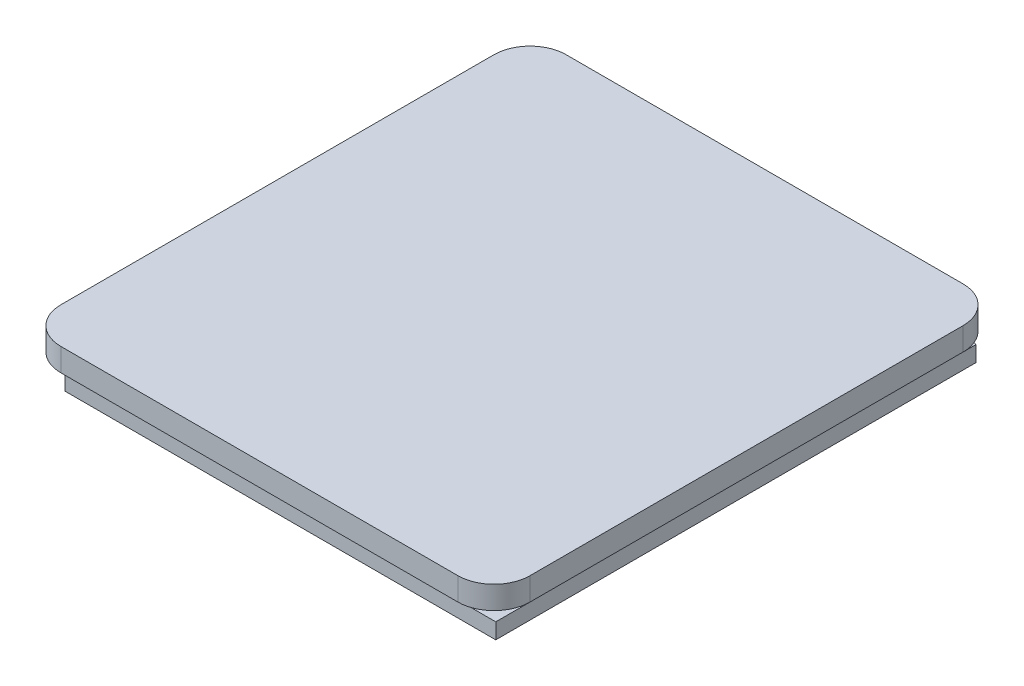
ISO-10303-21;
HEADER;
FILE_DESCRIPTION(('STEP AP214'),'2;1');
FILE_NAME('part.step','',(''),(''),'','','');
FILE_SCHEMA(('AUTOMOTIVE_DESIGN { 1 0 10303 214 1 1 1 1 }'));
ENDSEC;
DATA;
#1=APPLICATION_CONTEXT('core data for automotive mechanical design processes');
#2=APPLICATION_PROTOCOL_DEFINITION('international standard','automotive_design',2000,#1);
#3=PRODUCT_CONTEXT('',#1,'mechanical');
#4=PRODUCT('Part','Part','',(#3));
#5=PRODUCT_RELATED_PRODUCT_CATEGORY('part','',(#4));
#6=PRODUCT_DEFINITION_FORMATION('','',#4);
#7=PRODUCT_DEFINITION_CONTEXT('part definition',#1,'design');
#8=PRODUCT_DEFINITION('design','',#6,#7);
#9=PRODUCT_DEFINITION_SHAPE('','',#8);
#10=(LENGTH_UNIT() NAMED_UNIT(*) SI_UNIT(.MILLI.,.METRE.));
#11=(NAMED_UNIT(*) PLANE_ANGLE_UNIT() SI_UNIT($,.RADIAN.));
#12=(NAMED_UNIT(*) SI_UNIT($,.STERADIAN.) SOLID_ANGLE_UNIT());
#13=UNCERTAINTY_MEASURE_WITH_UNIT(LENGTH_MEASURE(1.E-05),#10,'distance_accuracy_value','');
#14=(GEOMETRIC_REPRESENTATION_CONTEXT(3) GLOBAL_UNCERTAINTY_ASSIGNED_CONTEXT((#13)) GLOBAL_UNIT_ASSIGNED_CONTEXT((#10,
#11,#12)) REPRESENTATION_CONTEXT('',''));
#15=CARTESIAN_POINT('',(0.,0.,0.));
#16=DIRECTION('',(0.,0.,1.));
#17=DIRECTION('',(1.,0.,0.));
#18=AXIS2_PLACEMENT_3D('',#15,#16,#17);
#19=CARTESIAN_POINT('',(-16.5,4.8,21.));
#20=DIRECTION('',(0.,0.,-1.));
#21=DIRECTION('',(-1.,0.,0.));
#22=AXIS2_PLACEMENT_3D('',#19,#20,#21);
#23=PLANE('',#22);
#24=DIRECTION('',(1.,0.,0.));
#25=VECTOR('',#24,1.);
#26=CARTESIAN_POINT('',(0.,2.9,21.));
#27=LINE('',#26,#25);
#28=CARTESIAN_POINT('',(-16.5,2.9,21.));
#29=VERTEX_POINT('',#28);
#30=CARTESIAN_POINT('',(16.5,2.9,21.));
#31=VERTEX_POINT('',#30);
#32=EDGE_CURVE('E199',#29,#31,#27,.T.);
#33=ORIENTED_EDGE('',*,*,#32,.T.);
#34=DIRECTION('',(0.,-1.,0.));
#35=VECTOR('',#34,1.);
#36=CARTESIAN_POINT('',(16.5,4.8,21.));
#37=LINE('',#36,#35);
#38=CARTESIAN_POINT('',(16.5,4.8,21.));
#39=VERTEX_POINT('',#38);
#40=EDGE_CURVE('E269',#39,#31,#37,.T.);
#41=ORIENTED_EDGE('',*,*,#40,.F.);
#42=DIRECTION('',(1.,0.,0.));
#43=VECTOR('',#42,1.);
#44=CARTESIAN_POINT('',(-16.5,4.8,21.));
#45=LINE('',#44,#43);
#46=CARTESIAN_POINT('',(-16.5,4.8,21.));
#47=VERTEX_POINT('',#46);
#48=EDGE_CURVE('E227',#47,#39,#45,.T.);
#49=ORIENTED_EDGE('',*,*,#48,.F.);
#50=DIRECTION('',(0.,-1.,0.));
#51=VECTOR('',#50,1.);
#52=CARTESIAN_POINT('',(-16.5,4.8,21.));
#53=LINE('',#52,#51);
#54=EDGE_CURVE('E272',#47,#29,#53,.T.);
#55=ORIENTED_EDGE('',*,*,#54,.T.);
#56=EDGE_LOOP('',(#33,#41,#49,#55));
#57=FACE_BOUND('',#56,.T.);
#58=ADVANCED_FACE('F32',(#57),#23,.F.);
#59=CARTESIAN_POINT('',(-16.5,4.8,-21.));
#60=DIRECTION('',(0.,0.,1.));
#61=DIRECTION('',(1.,0.,0.));
#62=AXIS2_PLACEMENT_3D('',#59,#60,#61);
#63=PLANE('',#62);
#64=DIRECTION('',(-1.,0.,0.));
#65=VECTOR('',#64,1.);
#66=CARTESIAN_POINT('',(-16.5,1.3,-21.));
#67=LINE('',#66,#65);
#68=CARTESIAN_POINT('',(16.5,1.3,-21.));
#69=VERTEX_POINT('',#68);
#70=CARTESIAN_POINT('',(16.2,1.3,-21.));
#71=VERTEX_POINT('',#70);
#72=EDGE_CURVE('E182',#69,#71,#67,.T.);
#73=ORIENTED_EDGE('',*,*,#72,.F.);
#74=DIRECTION('',(0.,-1.,0.));
#75=VECTOR('',#74,1.);
#76=CARTESIAN_POINT('',(16.5,4.8,-21.));
#77=LINE('',#76,#75);
#78=CARTESIAN_POINT('',(16.5,0.,-21.));
#79=VERTEX_POINT('',#78);
#80=EDGE_CURVE('E259',#69,#79,#77,.T.);
#81=ORIENTED_EDGE('',*,*,#80,.T.);
#82=DIRECTION('',(-1.,0.,0.));
#83=VECTOR('',#82,1.);
#84=CARTESIAN_POINT('',(-16.5,0.,-21.));
#85=LINE('',#84,#83);
#86=CARTESIAN_POINT('',(-16.5,0.,-21.));
#87=VERTEX_POINT('',#86);
#88=EDGE_CURVE('E245',#79,#87,#85,.T.);
#89=ORIENTED_EDGE('',*,*,#88,.T.);
#90=DIRECTION('',(0.,-1.,0.));
#91=VECTOR('',#90,1.);
#92=CARTESIAN_POINT('',(-16.5,4.8,-21.));
#93=LINE('',#92,#91);
#94=CARTESIAN_POINT('',(-16.5,1.3,-21.));
#95=VERTEX_POINT('',#94);
#96=EDGE_CURVE('E255',#95,#87,#93,.T.);
#97=ORIENTED_EDGE('',*,*,#96,.F.);
#98=DIRECTION('',(1.,0.,0.));
#99=VECTOR('',#98,1.);
#100=CARTESIAN_POINT('',(-16.5,1.3,-21.));
#101=LINE('',#100,#99);
#102=CARTESIAN_POINT('',(-16.2,1.3,-21.));
#103=VERTEX_POINT('',#102);
#104=EDGE_CURVE('E220',#95,#103,#101,.T.);
#105=ORIENTED_EDGE('',*,*,#104,.T.);
#106=DIRECTION('',(0.,-1.,0.));
#107=VECTOR('',#106,1.);
#108=CARTESIAN_POINT('',(-16.2,4.8,-21.));
#109=LINE('',#108,#107);
#110=CARTESIAN_POINT('',(-16.2,2.9,-21.));
#111=VERTEX_POINT('',#110);
#112=EDGE_CURVE('E280',#111,#103,#109,.T.);
#113=ORIENTED_EDGE('',*,*,#112,.F.);
#114=DIRECTION('',(1.,0.,0.));
#115=VECTOR('',#114,1.);
#116=CARTESIAN_POINT('',(-16.5,2.9,-21.));
#117=LINE('',#116,#115);
#118=CARTESIAN_POINT('',(-16.5,2.9,-21.));
#119=VERTEX_POINT('',#118);
#120=EDGE_CURVE('E215',#119,#111,#117,.T.);
#121=ORIENTED_EDGE('',*,*,#120,.F.);
#122=CARTESIAN_POINT('',(-16.5,4.8,-21.));
#123=VERTEX_POINT('',#122);
#124=EDGE_CURVE('E256',#123,#119,#93,.T.);
#125=ORIENTED_EDGE('',*,*,#124,.F.);
#126=DIRECTION('',(-1.,0.,0.));
#127=VECTOR('',#126,1.);
#128=CARTESIAN_POINT('',(-16.5,4.8,-21.));
#129=LINE('',#128,#127);
#130=CARTESIAN_POINT('',(16.5,4.8,-21.));
#131=VERTEX_POINT('',#130);
#132=EDGE_CURVE('E236',#131,#123,#129,.T.);
#133=ORIENTED_EDGE('',*,*,#132,.F.);
#134=CARTESIAN_POINT('',(16.5,2.9,-21.));
#135=VERTEX_POINT('',#134);
#136=EDGE_CURVE('E260',#131,#135,#77,.T.);
#137=ORIENTED_EDGE('',*,*,#136,.T.);
#138=DIRECTION('',(1.,0.,0.));
#139=VECTOR('',#138,1.);
#140=CARTESIAN_POINT('',(-16.5,2.9,-21.));
#141=LINE('',#140,#139);
#142=CARTESIAN_POINT('',(16.2,2.9,-21.));
#143=VERTEX_POINT('',#142);
#144=EDGE_CURVE('E183',#143,#135,#141,.T.);
#145=ORIENTED_EDGE('',*,*,#144,.F.);
#146=DIRECTION('',(0.,-1.,0.));
#147=VECTOR('',#146,1.);
#148=CARTESIAN_POINT('',(16.2,4.8,-21.));
#149=LINE('',#148,#147);
#150=EDGE_CURVE('E40',#143,#71,#149,.T.);
#151=ORIENTED_EDGE('',*,*,#150,.T.);
#152=EDGE_LOOP('',(#73,#81,#89,#97,#105,#113,#121,#125,#133,#137,#145,#151));
#153=FACE_BOUND('',#152,.T.);
#154=ADVANCED_FACE('F289',(#153),#63,.F.);
#155=CARTESIAN_POINT('',(16.5,4.8,18.));
#156=DIRECTION('',(0.,-1.,0.));
#157=DIRECTION('',(0.,0.,-1.));
#158=AXIS2_PLACEMENT_3D('',#155,#156,#157);
#159=CYLINDRICAL_SURFACE('',#158,3.);
#160=CARTESIAN_POINT('',(16.5,2.9,18.));
#161=DIRECTION('',(0.,-1.,0.));
#162=DIRECTION('',(0.,0.,-1.));
#163=AXIS2_PLACEMENT_3D('',#160,#161,#162);
#164=CIRCLE('',#163,3.);
#165=CARTESIAN_POINT('',(19.5,2.9,17.9999999999999));
#166=VERTEX_POINT('',#165);
#167=EDGE_CURVE('E185',#166,#31,#164,.T.);
#168=ORIENTED_EDGE('',*,*,#167,.F.);
#169=DIRECTION('',(0.,-1.,0.));
#170=VECTOR('',#169,1.);
#171=CARTESIAN_POINT('',(19.5,4.8,18.));
#172=LINE('',#171,#170);
#173=CARTESIAN_POINT('',(19.5,4.8,18.));
#174=VERTEX_POINT('',#173);
#175=EDGE_CURVE('E266',#174,#166,#172,.T.);
#176=ORIENTED_EDGE('',*,*,#175,.F.);
#177=CARTESIAN_POINT('',(16.5,4.8,18.));
#178=DIRECTION('',(0.,1.,0.));
#179=DIRECTION('',(0.,0.,1.));
#180=AXIS2_PLACEMENT_3D('',#177,#178,#179);
#181=CIRCLE('',#180,3.);
#182=EDGE_CURVE('E230',#39,#174,#181,.T.);
#183=ORIENTED_EDGE('',*,*,#182,.F.);
#184=ORIENTED_EDGE('',*,*,#40,.T.);
#185=EDGE_LOOP('',(#168,#176,#183,#184));
#186=FACE_BOUND('',#185,.T.);
#187=ADVANCED_FACE('F334',(#186),#159,.T.);
#188=CARTESIAN_POINT('',(19.5,4.8,18.));
#189=DIRECTION('',(-1.,0.,0.));
#190=DIRECTION('',(0.,0.,1.));
#191=AXIS2_PLACEMENT_3D('',#188,#189,#190);
#192=PLANE('',#191);
#193=DIRECTION('',(0.,0.,1.));
#194=VECTOR('',#193,1.);
#195=CARTESIAN_POINT('',(19.5,2.9,-93.8));
#196=LINE('',#195,#194);
#197=CARTESIAN_POINT('',(19.5,2.9,-18.));
#198=VERTEX_POINT('',#197);
#199=EDGE_CURVE('E187',#198,#166,#196,.T.);
#200=ORIENTED_EDGE('',*,*,#199,.F.);
#201=DIRECTION('',(0.,-1.,0.));
#202=VECTOR('',#201,1.);
#203=CARTESIAN_POINT('',(19.5,4.8,-18.));
#204=LINE('',#203,#202);
#205=CARTESIAN_POINT('',(19.5,4.8,-18.));
#206=VERTEX_POINT('',#205);
#207=EDGE_CURVE('E263',#206,#198,#204,.T.);
#208=ORIENTED_EDGE('',*,*,#207,.F.);
#209=DIRECTION('',(0.,0.,-1.));
#210=VECTOR('',#209,1.);
#211=CARTESIAN_POINT('',(19.5,4.8,18.));
#212=LINE('',#211,#210);
#213=EDGE_CURVE('E232',#174,#206,#212,.T.);
#214=ORIENTED_EDGE('',*,*,#213,.F.);
#215=ORIENTED_EDGE('',*,*,#175,.T.);
#216=EDGE_LOOP('',(#200,#208,#214,#215));
#217=FACE_BOUND('',#216,.T.);
#218=ADVANCED_FACE('F339',(#217),#192,.F.);
#219=CARTESIAN_POINT('',(16.5,4.8,-18.));
#220=DIRECTION('',(0.,-1.,0.));
#221=DIRECTION('',(0.,0.,-1.));
#222=AXIS2_PLACEMENT_3D('',#219,#220,#221);
#223=CYLINDRICAL_SURFACE('',#222,3.);
#224=CARTESIAN_POINT('',(16.5,2.9,-18.));
#225=DIRECTION('',(0.,-1.,0.));
#226=DIRECTION('',(0.,0.,-1.));
#227=AXIS2_PLACEMENT_3D('',#224,#225,#226);
#228=CIRCLE('',#227,3.);
#229=EDGE_CURVE('E286',#135,#198,#228,.T.);
#230=ORIENTED_EDGE('',*,*,#229,.F.);
#231=ORIENTED_EDGE('',*,*,#136,.F.);
#232=CARTESIAN_POINT('',(16.5,4.8,-18.));
#233=DIRECTION('',(0.,1.,0.));
#234=DIRECTION('',(0.,0.,-1.));
#235=AXIS2_PLACEMENT_3D('',#232,#233,#234);
#236=CIRCLE('',#235,3.);
#237=EDGE_CURVE('E234',#206,#131,#236,.T.);
#238=ORIENTED_EDGE('',*,*,#237,.F.);
#239=ORIENTED_EDGE('',*,*,#207,.T.);
#240=EDGE_LOOP('',(#230,#231,#238,#239));
#241=FACE_BOUND('',#240,.T.);
#242=ADVANCED_FACE('F343',(#241),#223,.T.);
#243=CARTESIAN_POINT('',(16.5,1.3,-18.));
#244=DIRECTION('',(0.,1.,0.));
#245=DIRECTION('',(-1.,0.,0.));
#246=AXIS2_PLACEMENT_3D('',#243,#244,#245);
#247=CIRCLE('',#246,3.);
#248=CARTESIAN_POINT('',(17.9,1.3,-20.6532998322844));
#249=VERTEX_POINT('',#248);
#250=EDGE_CURVE('E284',#249,#69,#247,.T.);
#251=ORIENTED_EDGE('',*,*,#250,.F.);
#252=DIRECTION('',(0.,-1.,0.));
#253=VECTOR('',#252,1.);
#254=CARTESIAN_POINT('',(17.9,4.8,-20.6532998322843));
#255=LINE('',#254,#253);
#256=CARTESIAN_POINT('',(17.9,0.,-20.6532998322843));
#257=VERTEX_POINT('',#256);
#258=EDGE_CURVE('E282',#249,#257,#255,.T.);
#259=ORIENTED_EDGE('',*,*,#258,.T.);
#260=CARTESIAN_POINT('',(16.5,0.,-18.));
#261=DIRECTION('',(0.,1.,0.));
#262=DIRECTION('',(0.,0.,-1.));
#263=AXIS2_PLACEMENT_3D('',#260,#261,#262);
#264=CIRCLE('',#263,3.);
#265=EDGE_CURVE('E223',#257,#79,#264,.T.);
#266=ORIENTED_EDGE('',*,*,#265,.T.);
#267=ORIENTED_EDGE('',*,*,#80,.F.);
#268=EDGE_LOOP('',(#251,#259,#266,#267));
#269=FACE_BOUND('',#268,.T.);
#270=ADVANCED_FACE('F318',(#269),#223,.T.);
#271=CARTESIAN_POINT('',(-16.5,4.8,18.));
#272=DIRECTION('',(0.,-1.,0.));
#273=DIRECTION('',(0.,0.,-1.));
#274=AXIS2_PLACEMENT_3D('',#271,#272,#273);
#275=CYLINDRICAL_SURFACE('',#274,3.);
#276=CARTESIAN_POINT('',(-16.5,2.9,18.));
#277=DIRECTION('',(0.,-1.,0.));
#278=DIRECTION('',(1.,0.,0.));
#279=AXIS2_PLACEMENT_3D('',#276,#277,#278);
#280=CIRCLE('',#279,3.);
#281=CARTESIAN_POINT('',(-19.5,2.9,17.9999999999999));
#282=VERTEX_POINT('',#281);
#283=EDGE_CURVE('E217',#29,#282,#280,.T.);
#284=ORIENTED_EDGE('',*,*,#283,.F.);
#285=ORIENTED_EDGE('',*,*,#54,.F.);
#286=CARTESIAN_POINT('',(-16.5,4.8,18.));
#287=DIRECTION('',(0.,1.,0.));
#288=DIRECTION('',(0.,0.,-1.));
#289=AXIS2_PLACEMENT_3D('',#286,#287,#288);
#290=CIRCLE('',#289,3.);
#291=CARTESIAN_POINT('',(-19.5,4.8,18.));
#292=VERTEX_POINT('',#291);
#293=EDGE_CURVE('E224',#292,#47,#290,.T.);
#294=ORIENTED_EDGE('',*,*,#293,.F.);
#295=DIRECTION('',(0.,-1.,0.));
#296=VECTOR('',#295,1.);
#297=CARTESIAN_POINT('',(-19.5,4.8,18.));
#298=LINE('',#297,#296);
#299=EDGE_CURVE('E242',#292,#282,#298,.T.);
#300=ORIENTED_EDGE('',*,*,#299,.T.);
#301=EDGE_LOOP('',(#284,#285,#294,#300));
#302=FACE_BOUND('',#301,.T.);
#303=ADVANCED_FACE('F34',(#302),#275,.T.);
#304=CARTESIAN_POINT('',(-16.5,4.8,-18.));
#305=DIRECTION('',(0.,-1.,0.));
#306=DIRECTION('',(0.,0.,-1.));
#307=AXIS2_PLACEMENT_3D('',#304,#305,#306);
#308=CYLINDRICAL_SURFACE('',#307,3.);
#309=CARTESIAN_POINT('',(-16.5,2.9,-18.));
#310=DIRECTION('',(0.,-1.,0.));
#311=DIRECTION('',(1.,0.,0.));
#312=AXIS2_PLACEMENT_3D('',#309,#310,#311);
#313=CIRCLE('',#312,3.);
#314=CARTESIAN_POINT('',(-19.5,2.9,-18.));
#315=VERTEX_POINT('',#314);
#316=EDGE_CURVE('E213',#315,#119,#313,.T.);
#317=ORIENTED_EDGE('',*,*,#316,.F.);
#318=DIRECTION('',(0.,-1.,0.));
#319=VECTOR('',#318,1.);
#320=CARTESIAN_POINT('',(-19.5,4.8,-18.));
#321=LINE('',#320,#319);
#322=CARTESIAN_POINT('',(-19.5,4.8,-18.));
#323=VERTEX_POINT('',#322);
#324=EDGE_CURVE('E252',#323,#315,#321,.T.);
#325=ORIENTED_EDGE('',*,*,#324,.F.);
#326=CARTESIAN_POINT('',(-16.5,4.8,-18.));
#327=DIRECTION('',(0.,1.,0.));
#328=DIRECTION('',(0.,0.,-1.));
#329=AXIS2_PLACEMENT_3D('',#326,#327,#328);
#330=CIRCLE('',#329,3.);
#331=EDGE_CURVE('E238',#123,#323,#330,.T.);
#332=ORIENTED_EDGE('',*,*,#331,.F.);
#333=ORIENTED_EDGE('',*,*,#124,.T.);
#334=EDGE_LOOP('',(#317,#325,#332,#333));
#335=FACE_BOUND('',#334,.T.);
#336=ADVANCED_FACE('F351',(#335),#308,.T.);
#337=CARTESIAN_POINT('',(-19.5,4.8,18.));
#338=DIRECTION('',(1.,0.,0.));
#339=DIRECTION('',(0.,0.,-1.));
#340=AXIS2_PLACEMENT_3D('',#337,#338,#339);
#341=PLANE('',#340);
#342=DIRECTION('',(0.,0.,1.));
#343=VECTOR('',#342,1.);
#344=CARTESIAN_POINT('',(-19.5,2.9,-93.8));
#345=LINE('',#344,#343);
#346=EDGE_CURVE('E202',#315,#282,#345,.T.);
#347=ORIENTED_EDGE('',*,*,#346,.T.);
#348=ORIENTED_EDGE('',*,*,#299,.F.);
#349=DIRECTION('',(0.,0.,1.));
#350=VECTOR('',#349,1.);
#351=CARTESIAN_POINT('',(-19.5,4.8,18.));
#352=LINE('',#351,#350);
#353=EDGE_CURVE('E240',#323,#292,#352,.T.);
#354=ORIENTED_EDGE('',*,*,#353,.F.);
#355=ORIENTED_EDGE('',*,*,#324,.T.);
#356=EDGE_LOOP('',(#347,#348,#354,#355));
#357=FACE_BOUND('',#356,.T.);
#358=ADVANCED_FACE('F352',(#357),#341,.F.);
#359=CARTESIAN_POINT('',(-16.5,0.,18.));
#360=DIRECTION('',(0.,-1.,0.));
#361=DIRECTION('',(0.,0.,-1.));
#362=AXIS2_PLACEMENT_3D('',#359,#360,#361);
#363=PLANE('',#362);
#364=DIRECTION('',(-1.,0.,0.));
#365=VECTOR('',#364,1.);
#366=CARTESIAN_POINT('',(95.3,0.,19.25));
#367=LINE('',#366,#365);
#368=CARTESIAN_POINT('',(17.9,0.,19.2499999999999));
#369=VERTEX_POINT('',#368);
#370=CARTESIAN_POINT('',(-17.9,0.,19.25));
#371=VERTEX_POINT('',#370);
#372=EDGE_CURVE('E47',#369,#371,#367,.T.);
#373=ORIENTED_EDGE('',*,*,#372,.T.);
#374=DIRECTION('',(0.,0.,-1.));
#375=VECTOR('',#374,1.);
#376=CARTESIAN_POINT('',(-17.9,0.,18.));
#377=LINE('',#376,#375);
#378=CARTESIAN_POINT('',(-17.9,0.,-20.6532998322843));
#379=VERTEX_POINT('',#378);
#380=EDGE_CURVE('E275',#371,#379,#377,.T.);
#381=ORIENTED_EDGE('',*,*,#380,.T.);
#382=CARTESIAN_POINT('',(-16.5,0.,-18.));
#383=DIRECTION('',(0.,1.,0.));
#384=DIRECTION('',(0.,0.,-1.));
#385=AXIS2_PLACEMENT_3D('',#382,#383,#384);
#386=CIRCLE('',#385,3.);
#387=EDGE_CURVE('E228',#87,#379,#386,.T.);
#388=ORIENTED_EDGE('',*,*,#387,.F.);
#389=ORIENTED_EDGE('',*,*,#88,.F.);
#390=ORIENTED_EDGE('',*,*,#265,.F.);
#391=DIRECTION('',(0.,0.,1.));
#392=VECTOR('',#391,1.);
#393=CARTESIAN_POINT('',(17.9,0.,-93.8));
#394=LINE('',#393,#392);
#395=EDGE_CURVE('E53',#257,#369,#394,.T.);
#396=ORIENTED_EDGE('',*,*,#395,.T.);
#397=EDGE_LOOP('',(#373,#381,#388,#389,#390,#396));
#398=FACE_BOUND('',#397,.T.);
#399=ADVANCED_FACE('F310',(#398),#363,.T.);
#400=DIRECTION('',(0.,-1.,0.));
#401=VECTOR('',#400,1.);
#402=CARTESIAN_POINT('',(-17.9,4.8,-20.6532998322843));
#403=LINE('',#402,#401);
#404=CARTESIAN_POINT('',(-17.9,1.3,-20.6532998322844));
#405=VERTEX_POINT('',#404);
#406=EDGE_CURVE('E204',#405,#379,#403,.T.);
#407=ORIENTED_EDGE('',*,*,#406,.F.);
#408=CARTESIAN_POINT('',(-16.5,1.3,-18.));
#409=DIRECTION('',(0.,-1.,0.));
#410=DIRECTION('',(1.,0.,0.));
#411=AXIS2_PLACEMENT_3D('',#408,#409,#410);
#412=CIRCLE('',#411,3.);
#413=EDGE_CURVE('E277',#405,#95,#412,.T.);
#414=ORIENTED_EDGE('',*,*,#413,.T.);
#415=ORIENTED_EDGE('',*,*,#96,.T.);
#416=ORIENTED_EDGE('',*,*,#387,.T.);
#417=EDGE_LOOP('',(#407,#414,#415,#416));
#418=FACE_BOUND('',#417,.T.);
#419=ADVANCED_FACE('F314',(#418),#308,.T.);
#420=CARTESIAN_POINT('',(-16.5,4.8,18.));
#421=DIRECTION('',(0.,-1.,0.));
#422=DIRECTION('',(0.,0.,-1.));
#423=AXIS2_PLACEMENT_3D('',#420,#421,#422);
#424=PLANE('',#423);
#425=ORIENTED_EDGE('',*,*,#293,.T.);
#426=ORIENTED_EDGE('',*,*,#48,.T.);
#427=ORIENTED_EDGE('',*,*,#182,.T.);
#428=ORIENTED_EDGE('',*,*,#213,.T.);
#429=ORIENTED_EDGE('',*,*,#237,.T.);
#430=ORIENTED_EDGE('',*,*,#132,.T.);
#431=ORIENTED_EDGE('',*,*,#331,.T.);
#432=ORIENTED_EDGE('',*,*,#353,.T.);
#433=EDGE_LOOP('',(#425,#426,#427,#428,#429,#430,#431,#432));
#434=FACE_BOUND('',#433,.T.);
#435=ADVANCED_FACE('F350',(#434),#424,.F.);
#436=CARTESIAN_POINT('',(-16.2,0.,-93.8));
#437=DIRECTION('',(-1.,0.,0.));
#438=DIRECTION('',(0.,0.,1.));
#439=AXIS2_PLACEMENT_3D('',#436,#437,#438);
#440=PLANE('',#439);
#441=DIRECTION('',(0.,-1.,0.));
#442=VECTOR('',#441,1.);
#443=CARTESIAN_POINT('',(-16.2,0.,17.4999999999999));
#444=LINE('',#443,#442);
#445=CARTESIAN_POINT('',(-16.2,2.9,17.4999999999999));
#446=VERTEX_POINT('',#445);
#447=CARTESIAN_POINT('',(-16.2,1.3,17.4999999999999));
#448=VERTEX_POINT('',#447);
#449=EDGE_CURVE('E162',#446,#448,#444,.T.);
#450=ORIENTED_EDGE('',*,*,#449,.F.);
#451=DIRECTION('',(0.,0.,1.));
#452=VECTOR('',#451,1.);
#453=CARTESIAN_POINT('',(-16.2,2.9,-93.8));
#454=LINE('',#453,#452);
#455=EDGE_CURVE('E205',#111,#446,#454,.T.);
#456=ORIENTED_EDGE('',*,*,#455,.F.);
#457=ORIENTED_EDGE('',*,*,#112,.T.);
#458=DIRECTION('',(0.,0.,1.));
#459=VECTOR('',#458,1.);
#460=CARTESIAN_POINT('',(-16.2,1.3,-93.8));
#461=LINE('',#460,#459);
#462=EDGE_CURVE('E208',#103,#448,#461,.T.);
#463=ORIENTED_EDGE('',*,*,#462,.T.);
#464=EDGE_LOOP('',(#450,#456,#457,#463));
#465=FACE_BOUND('',#464,.T.);
#466=ADVANCED_FACE('F360',(#465),#440,.T.);
#467=CARTESIAN_POINT('',(0.,1.3,-93.8));
#468=DIRECTION('',(0.,-1.,0.));
#469=DIRECTION('',(1.,0.,0.));
#470=AXIS2_PLACEMENT_3D('',#467,#468,#469);
#471=PLANE('',#470);
#472=DIRECTION('',(0.,0.,1.));
#473=VECTOR('',#472,1.);
#474=CARTESIAN_POINT('',(-17.9,1.3,-93.8));
#475=LINE('',#474,#473);
#476=CARTESIAN_POINT('',(-17.9,1.3,19.25));
#477=VERTEX_POINT('',#476);
#478=EDGE_CURVE('E201',#405,#477,#475,.T.);
#479=ORIENTED_EDGE('',*,*,#478,.T.);
#480=DIRECTION('',(-1.,0.,0.));
#481=VECTOR('',#480,1.);
#482=CARTESIAN_POINT('',(95.3,1.3,19.25));
#483=LINE('',#482,#481);
#484=CARTESIAN_POINT('',(17.9,1.3,19.25));
#485=VERTEX_POINT('',#484);
#486=EDGE_CURVE('E167',#485,#477,#483,.T.);
#487=ORIENTED_EDGE('',*,*,#486,.F.);
#488=DIRECTION('',(0.,0.,1.));
#489=VECTOR('',#488,1.);
#490=CARTESIAN_POINT('',(17.9,1.3,-93.8));
#491=LINE('',#490,#489);
#492=EDGE_CURVE('E193',#249,#485,#491,.T.);
#493=ORIENTED_EDGE('',*,*,#492,.F.);
#494=ORIENTED_EDGE('',*,*,#250,.T.);
#495=ORIENTED_EDGE('',*,*,#72,.T.);
#496=DIRECTION('',(0.,0.,1.));
#497=VECTOR('',#496,1.);
#498=CARTESIAN_POINT('',(16.2,1.3,-93.8));
#499=LINE('',#498,#497);
#500=CARTESIAN_POINT('',(16.2,1.3,17.4999999999999));
#501=VERTEX_POINT('',#500);
#502=EDGE_CURVE('E174',#71,#501,#499,.T.);
#503=ORIENTED_EDGE('',*,*,#502,.T.);
#504=DIRECTION('',(-1.,0.,0.));
#505=VECTOR('',#504,1.);
#506=CARTESIAN_POINT('',(95.3,1.3,17.4999999999999));
#507=LINE('',#506,#505);
#508=EDGE_CURVE('E156',#501,#448,#507,.T.);
#509=ORIENTED_EDGE('',*,*,#508,.T.);
#510=ORIENTED_EDGE('',*,*,#462,.F.);
#511=ORIENTED_EDGE('',*,*,#104,.F.);
#512=ORIENTED_EDGE('',*,*,#413,.F.);
#513=EDGE_LOOP('',(#479,#487,#493,#494,#495,#503,#509,#510,#511,#512));
#514=FACE_BOUND('',#513,.T.);
#515=ADVANCED_FACE('F180',(#514),#471,.F.);
#516=CARTESIAN_POINT('',(0.,2.9,-93.8));
#517=DIRECTION('',(0.,-1.,0.));
#518=DIRECTION('',(1.,0.,0.));
#519=AXIS2_PLACEMENT_3D('',#516,#517,#518);
#520=PLANE('',#519);
#521=ORIENTED_EDGE('',*,*,#455,.T.);
#522=DIRECTION('',(-1.,0.,0.));
#523=VECTOR('',#522,1.);
#524=CARTESIAN_POINT('',(95.3,2.9,17.4999999999999));
#525=LINE('',#524,#523);
#526=CARTESIAN_POINT('',(16.2,2.9,17.4999999999999));
#527=VERTEX_POINT('',#526);
#528=EDGE_CURVE('E168',#527,#446,#525,.T.);
#529=ORIENTED_EDGE('',*,*,#528,.F.);
#530=DIRECTION('',(0.,0.,1.));
#531=VECTOR('',#530,1.);
#532=CARTESIAN_POINT('',(16.2,2.9,-93.8));
#533=LINE('',#532,#531);
#534=EDGE_CURVE('E177',#143,#527,#533,.T.);
#535=ORIENTED_EDGE('',*,*,#534,.F.);
#536=ORIENTED_EDGE('',*,*,#144,.T.);
#537=ORIENTED_EDGE('',*,*,#229,.T.);
#538=ORIENTED_EDGE('',*,*,#199,.T.);
#539=ORIENTED_EDGE('',*,*,#167,.T.);
#540=ORIENTED_EDGE('',*,*,#32,.F.);
#541=ORIENTED_EDGE('',*,*,#283,.T.);
#542=ORIENTED_EDGE('',*,*,#346,.F.);
#543=ORIENTED_EDGE('',*,*,#316,.T.);
#544=ORIENTED_EDGE('',*,*,#120,.T.);
#545=EDGE_LOOP('',(#521,#529,#535,#536,#537,#538,#539,#540,#541,#542,#543,#544));
#546=FACE_BOUND('',#545,.T.);
#547=ADVANCED_FACE('F292',(#546),#520,.T.);
#548=CARTESIAN_POINT('',(-17.9,0.,-93.8));
#549=DIRECTION('',(-1.,0.,0.));
#550=DIRECTION('',(0.,0.,1.));
#551=AXIS2_PLACEMENT_3D('',#548,#549,#550);
#552=PLANE('',#551);
#553=DIRECTION('',(0.,-1.,0.));
#554=VECTOR('',#553,1.);
#555=CARTESIAN_POINT('',(-17.9,0.,19.25));
#556=LINE('',#555,#554);
#557=EDGE_CURVE('E178',#477,#371,#556,.T.);
#558=ORIENTED_EDGE('',*,*,#557,.F.);
#559=ORIENTED_EDGE('',*,*,#478,.F.);
#560=ORIENTED_EDGE('',*,*,#406,.T.);
#561=ORIENTED_EDGE('',*,*,#380,.F.);
#562=EDGE_LOOP('',(#558,#559,#560,#561));
#563=FACE_BOUND('',#562,.T.);
#564=ADVANCED_FACE('F307',(#563),#552,.T.);
#565=CARTESIAN_POINT('',(16.2,0.,-93.8));
#566=DIRECTION('',(-1.,0.,0.));
#567=DIRECTION('',(0.,0.,1.));
#568=AXIS2_PLACEMENT_3D('',#565,#566,#567);
#569=PLANE('',#568);
#570=ORIENTED_EDGE('',*,*,#534,.T.);
#571=DIRECTION('',(0.,-1.,0.));
#572=VECTOR('',#571,1.);
#573=CARTESIAN_POINT('',(16.2,0.,17.4999999999999));
#574=LINE('',#573,#572);
#575=EDGE_CURVE('E159',#527,#501,#574,.T.);
#576=ORIENTED_EDGE('',*,*,#575,.T.);
#577=ORIENTED_EDGE('',*,*,#502,.F.);
#578=ORIENTED_EDGE('',*,*,#150,.F.);
#579=EDGE_LOOP('',(#570,#576,#577,#578));
#580=FACE_BOUND('',#579,.T.);
#581=ADVANCED_FACE('F173',(#580),#569,.F.);
#582=CARTESIAN_POINT('',(17.9,0.,-93.8));
#583=DIRECTION('',(-1.,0.,0.));
#584=DIRECTION('',(0.,0.,1.));
#585=AXIS2_PLACEMENT_3D('',#582,#583,#584);
#586=PLANE('',#585);
#587=ORIENTED_EDGE('',*,*,#492,.T.);
#588=DIRECTION('',(0.,-1.,0.));
#589=VECTOR('',#588,1.);
#590=CARTESIAN_POINT('',(17.9,0.,19.25));
#591=LINE('',#590,#589);
#592=EDGE_CURVE('E11',#485,#369,#591,.T.);
#593=ORIENTED_EDGE('',*,*,#592,.T.);
#594=ORIENTED_EDGE('',*,*,#395,.F.);
#595=ORIENTED_EDGE('',*,*,#258,.F.);
#596=EDGE_LOOP('',(#587,#593,#594,#595));
#597=FACE_BOUND('',#596,.T.);
#598=ADVANCED_FACE('F319',(#597),#586,.F.);
#599=CARTESIAN_POINT('',(95.3,2.9,17.4999999999999));
#600=DIRECTION('',(0.,0.,-1.));
#601=DIRECTION('',(-1.,0.,0.));
#602=AXIS2_PLACEMENT_3D('',#599,#600,#601);
#603=PLANE('',#602);
#604=ORIENTED_EDGE('',*,*,#449,.T.);
#605=ORIENTED_EDGE('',*,*,#508,.F.);
#606=ORIENTED_EDGE('',*,*,#575,.F.);
#607=ORIENTED_EDGE('',*,*,#528,.T.);
#608=EDGE_LOOP('',(#604,#605,#606,#607));
#609=FACE_BOUND('',#608,.T.);
#610=ADVANCED_FACE('F158',(#609),#603,.F.);
#611=CARTESIAN_POINT('',(95.3,1.3,19.25));
#612=DIRECTION('',(0.,0.,-1.));
#613=DIRECTION('',(-1.,0.,0.));
#614=AXIS2_PLACEMENT_3D('',#611,#612,#613);
#615=PLANE('',#614);
#616=ORIENTED_EDGE('',*,*,#557,.T.);
#617=ORIENTED_EDGE('',*,*,#372,.F.);
#618=ORIENTED_EDGE('',*,*,#592,.F.);
#619=ORIENTED_EDGE('',*,*,#486,.T.);
#620=EDGE_LOOP('',(#616,#617,#618,#619));
#621=FACE_BOUND('',#620,.T.);
#622=ADVANCED_FACE('F303',(#621),#615,.F.);
#623=CLOSED_SHELL('',(#58,#154,#187,#218,#242,#270,#303,#336,#358,#399,#419,#435,#466,#515,#547,
#564,#581,#598,#610,#622));
#624=MANIFOLD_SOLID_BREP('B2',#623);
#625=ADVANCED_BREP_SHAPE_REPRESENTATION('',(#18,#624),#14);
#626=SHAPE_DEFINITION_REPRESENTATION(#9,#625);
ENDSEC;
END-ISO-10303-21;
